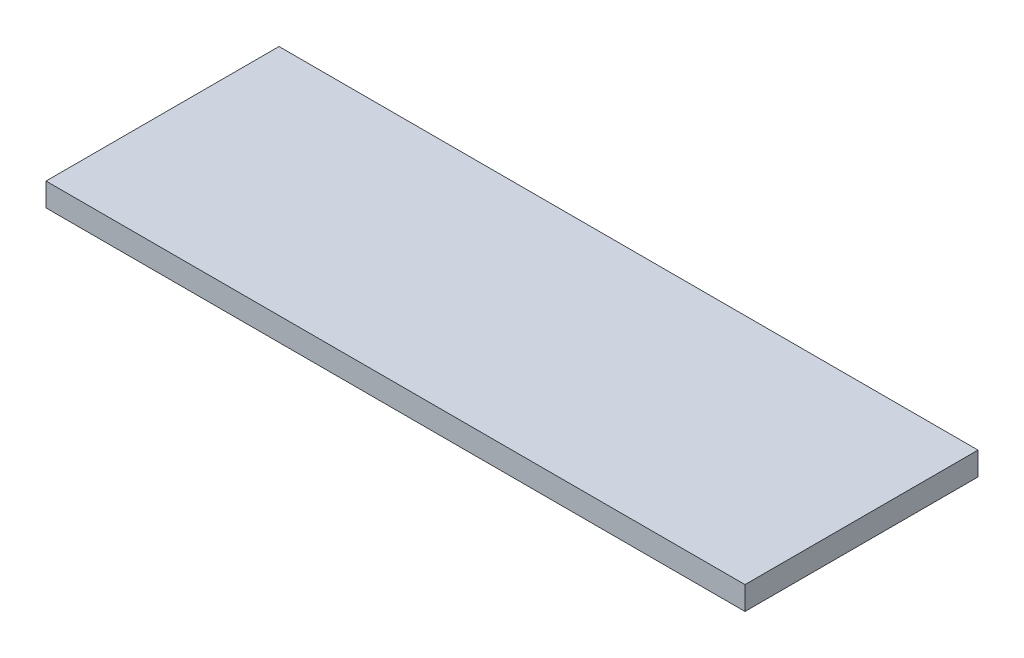
ISO-10303-21;
HEADER;
FILE_DESCRIPTION(('STEP AP214'),'2;1');
FILE_NAME('part.step','',(''),(''),'','','');
FILE_SCHEMA(('AUTOMOTIVE_DESIGN { 1 0 10303 214 1 1 1 1 }'));
ENDSEC;
DATA;
#1=APPLICATION_CONTEXT('core data for automotive mechanical design processes');
#2=APPLICATION_PROTOCOL_DEFINITION('international standard','automotive_design',2000,#1);
#3=PRODUCT_CONTEXT('',#1,'mechanical');
#4=PRODUCT('Part','Part','',(#3));
#5=PRODUCT_RELATED_PRODUCT_CATEGORY('part','',(#4));
#6=PRODUCT_DEFINITION_FORMATION('','',#4);
#7=PRODUCT_DEFINITION_CONTEXT('part definition',#1,'design');
#8=PRODUCT_DEFINITION('design','',#6,#7);
#9=PRODUCT_DEFINITION_SHAPE('','',#8);
#10=(LENGTH_UNIT() NAMED_UNIT(*) SI_UNIT(.MILLI.,.METRE.));
#11=(NAMED_UNIT(*) PLANE_ANGLE_UNIT() SI_UNIT($,.RADIAN.));
#12=(NAMED_UNIT(*) SI_UNIT($,.STERADIAN.) SOLID_ANGLE_UNIT());
#13=UNCERTAINTY_MEASURE_WITH_UNIT(LENGTH_MEASURE(1.E-05),#10,'distance_accuracy_value','');
#14=(GEOMETRIC_REPRESENTATION_CONTEXT(3) GLOBAL_UNCERTAINTY_ASSIGNED_CONTEXT((#13)) GLOBAL_UNIT_ASSIGNED_CONTEXT((#10,
#11,#12)) REPRESENTATION_CONTEXT('',''));
#15=CARTESIAN_POINT('',(0.,0.,0.));
#16=DIRECTION('',(0.,0.,1.));
#17=DIRECTION('',(1.,0.,0.));
#18=AXIS2_PLACEMENT_3D('',#15,#16,#17);
#19=CARTESIAN_POINT('',(0.,1.,0.));
#20=DIRECTION('',(1.,0.,0.));
#21=DIRECTION('',(0.,0.,-1.));
#22=AXIS2_PLACEMENT_3D('',#19,#20,#21);
#23=PLANE('',#22);
#24=DIRECTION('',(0.,0.,1.));
#25=VECTOR('',#24,1.);
#26=CARTESIAN_POINT('',(0.,0.,0.));
#27=LINE('',#26,#25);
#28=CARTESIAN_POINT('',(0.,0.,-10.));
#29=VERTEX_POINT('',#28);
#30=CARTESIAN_POINT('',(0.,0.,0.));
#31=VERTEX_POINT('',#30);
#32=EDGE_CURVE('E107',#29,#31,#27,.T.);
#33=ORIENTED_EDGE('',*,*,#32,.T.);
#34=DIRECTION('',(0.,-1.,0.));
#35=VECTOR('',#34,1.);
#36=CARTESIAN_POINT('',(0.,1.,0.));
#37=LINE('',#36,#35);
#38=CARTESIAN_POINT('',(0.,1.,0.));
#39=VERTEX_POINT('',#38);
#40=EDGE_CURVE('E11',#39,#31,#37,.T.);
#41=ORIENTED_EDGE('',*,*,#40,.F.);
#42=DIRECTION('',(0.,0.,1.));
#43=VECTOR('',#42,1.);
#44=CARTESIAN_POINT('',(0.,1.,0.));
#45=LINE('',#44,#43);
#46=CARTESIAN_POINT('',(0.,1.,-10.));
#47=VERTEX_POINT('',#46);
#48=EDGE_CURVE('E91',#47,#39,#45,.T.);
#49=ORIENTED_EDGE('',*,*,#48,.F.);
#50=DIRECTION('',(0.,-1.,0.));
#51=VECTOR('',#50,1.);
#52=CARTESIAN_POINT('',(0.,1.,-10.));
#53=LINE('',#52,#51);
#54=EDGE_CURVE('E103',#47,#29,#53,.T.);
#55=ORIENTED_EDGE('',*,*,#54,.T.);
#56=EDGE_LOOP('',(#33,#41,#49,#55));
#57=FACE_BOUND('',#56,.T.);
#58=ADVANCED_FACE('F39',(#57),#23,.F.);
#59=CARTESIAN_POINT('',(0.,1.,0.));
#60=DIRECTION('',(0.,0.,-1.));
#61=DIRECTION('',(-1.,0.,0.));
#62=AXIS2_PLACEMENT_3D('',#59,#60,#61);
#63=PLANE('',#62);
#64=DIRECTION('',(1.,0.,0.));
#65=VECTOR('',#64,1.);
#66=CARTESIAN_POINT('',(0.,0.,0.));
#67=LINE('',#66,#65);
#68=CARTESIAN_POINT('',(30.,0.,0.));
#69=VERTEX_POINT('',#68);
#70=EDGE_CURVE('E96',#31,#69,#67,.T.);
#71=ORIENTED_EDGE('',*,*,#70,.T.);
#72=DIRECTION('',(0.,-1.,0.));
#73=VECTOR('',#72,1.);
#74=CARTESIAN_POINT('',(30.,1.,0.));
#75=LINE('',#74,#73);
#76=CARTESIAN_POINT('',(30.,1.,0.));
#77=VERTEX_POINT('',#76);
#78=EDGE_CURVE('E48',#77,#69,#75,.T.);
#79=ORIENTED_EDGE('',*,*,#78,.F.);
#80=DIRECTION('',(1.,0.,0.));
#81=VECTOR('',#80,1.);
#82=CARTESIAN_POINT('',(0.,1.,0.));
#83=LINE('',#82,#81);
#84=EDGE_CURVE('E86',#39,#77,#83,.T.);
#85=ORIENTED_EDGE('',*,*,#84,.F.);
#86=ORIENTED_EDGE('',*,*,#40,.T.);
#87=EDGE_LOOP('',(#71,#79,#85,#86));
#88=FACE_BOUND('',#87,.T.);
#89=ADVANCED_FACE('F95',(#88),#63,.F.);
#90=CARTESIAN_POINT('',(30.,1.,0.));
#91=DIRECTION('',(-1.,0.,0.));
#92=DIRECTION('',(0.,0.,1.));
#93=AXIS2_PLACEMENT_3D('',#90,#91,#92);
#94=PLANE('',#93);
#95=DIRECTION('',(0.,0.,-1.));
#96=VECTOR('',#95,1.);
#97=CARTESIAN_POINT('',(30.,0.,0.));
#98=LINE('',#97,#96);
#99=CARTESIAN_POINT('',(30.,0.,-10.));
#100=VERTEX_POINT('',#99);
#101=EDGE_CURVE('E73',#69,#100,#98,.T.);
#102=ORIENTED_EDGE('',*,*,#101,.T.);
#103=DIRECTION('',(0.,-1.,0.));
#104=VECTOR('',#103,1.);
#105=CARTESIAN_POINT('',(30.,1.,-10.));
#106=LINE('',#105,#104);
#107=CARTESIAN_POINT('',(30.,1.,-10.));
#108=VERTEX_POINT('',#107);
#109=EDGE_CURVE('E98',#108,#100,#106,.T.);
#110=ORIENTED_EDGE('',*,*,#109,.F.);
#111=DIRECTION('',(0.,0.,-1.));
#112=VECTOR('',#111,1.);
#113=CARTESIAN_POINT('',(30.,1.,0.));
#114=LINE('',#113,#112);
#115=EDGE_CURVE('E89',#77,#108,#114,.T.);
#116=ORIENTED_EDGE('',*,*,#115,.F.);
#117=ORIENTED_EDGE('',*,*,#78,.T.);
#118=EDGE_LOOP('',(#102,#110,#116,#117));
#119=FACE_BOUND('',#118,.T.);
#120=ADVANCED_FACE('F99',(#119),#94,.F.);
#121=CARTESIAN_POINT('',(0.,1.,-10.));
#122=DIRECTION('',(0.,0.,1.));
#123=DIRECTION('',(1.,0.,0.));
#124=AXIS2_PLACEMENT_3D('',#121,#122,#123);
#125=PLANE('',#124);
#126=DIRECTION('',(-1.,0.,0.));
#127=VECTOR('',#126,1.);
#128=CARTESIAN_POINT('',(0.,0.,-10.));
#129=LINE('',#128,#127);
#130=EDGE_CURVE('E79',#100,#29,#129,.T.);
#131=ORIENTED_EDGE('',*,*,#130,.T.);
#132=ORIENTED_EDGE('',*,*,#54,.F.);
#133=DIRECTION('',(-1.,0.,0.));
#134=VECTOR('',#133,1.);
#135=CARTESIAN_POINT('',(0.,1.,-10.));
#136=LINE('',#135,#134);
#137=EDGE_CURVE('E56',#108,#47,#136,.T.);
#138=ORIENTED_EDGE('',*,*,#137,.F.);
#139=ORIENTED_EDGE('',*,*,#109,.T.);
#140=EDGE_LOOP('',(#131,#132,#138,#139));
#141=FACE_BOUND('',#140,.T.);
#142=ADVANCED_FACE('F120',(#141),#125,.F.);
#143=CARTESIAN_POINT('',(0.,1.,0.));
#144=DIRECTION('',(0.,-1.,0.));
#145=DIRECTION('',(0.,0.,-1.));
#146=AXIS2_PLACEMENT_3D('',#143,#144,#145);
#147=PLANE('',#146);
#148=ORIENTED_EDGE('',*,*,#48,.T.);
#149=ORIENTED_EDGE('',*,*,#84,.T.);
#150=ORIENTED_EDGE('',*,*,#115,.T.);
#151=ORIENTED_EDGE('',*,*,#137,.T.);
#152=EDGE_LOOP('',(#148,#149,#150,#151));
#153=FACE_BOUND('',#152,.T.);
#154=ADVANCED_FACE('F87',(#153),#147,.F.);
#155=CARTESIAN_POINT('',(0.,0.,0.));
#156=DIRECTION('',(0.,-1.,0.));
#157=DIRECTION('',(0.,0.,-1.));
#158=AXIS2_PLACEMENT_3D('',#155,#156,#157);
#159=PLANE('',#158);
#160=ORIENTED_EDGE('',*,*,#32,.F.);
#161=ORIENTED_EDGE('',*,*,#130,.F.);
#162=ORIENTED_EDGE('',*,*,#101,.F.);
#163=ORIENTED_EDGE('',*,*,#70,.F.);
#164=EDGE_LOOP('',(#160,#161,#162,#163));
#165=FACE_BOUND('',#164,.T.);
#166=ADVANCED_FACE('F123',(#165),#159,.T.);
#167=CLOSED_SHELL('',(#58,#89,#120,#142,#154,#166));
#168=MANIFOLD_SOLID_BREP('B2',#167);
#169=ADVANCED_BREP_SHAPE_REPRESENTATION('',(#18,#168),#14);
#170=SHAPE_DEFINITION_REPRESENTATION(#9,#169);
ENDSEC;
END-ISO-10303-21;
